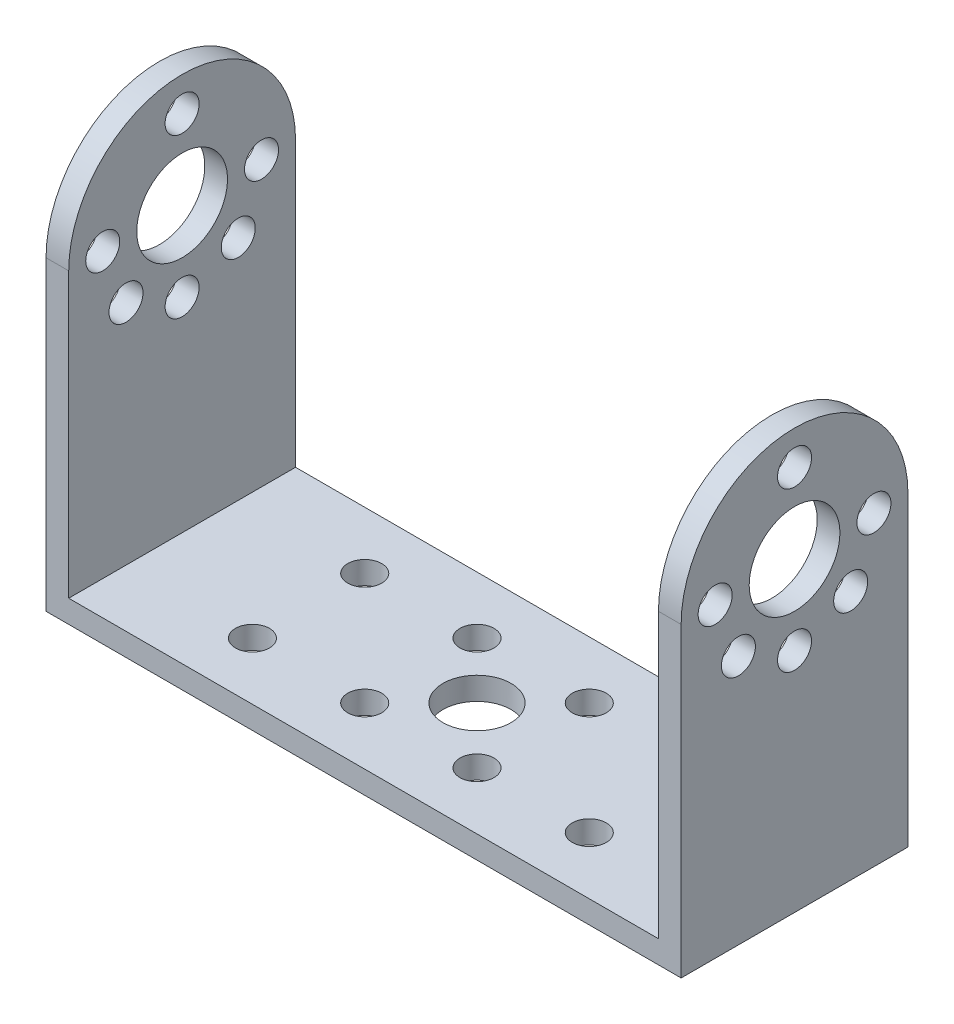
ISO-10303-21;
HEADER;
FILE_DESCRIPTION(('STEP AP214'),'2;1');
FILE_NAME('part.step','',(''),(''),'','','');
FILE_SCHEMA(('AUTOMOTIVE_DESIGN { 1 0 10303 214 1 1 1 1 }'));
ENDSEC;
DATA;
#1=APPLICATION_CONTEXT('core data for automotive mechanical design processes');
#2=APPLICATION_PROTOCOL_DEFINITION('international standard','automotive_design',2000,#1);
#3=PRODUCT_CONTEXT('',#1,'mechanical');
#4=PRODUCT('Part','Part','',(#3));
#5=PRODUCT_RELATED_PRODUCT_CATEGORY('part','',(#4));
#6=PRODUCT_DEFINITION_FORMATION('','',#4);
#7=PRODUCT_DEFINITION_CONTEXT('part definition',#1,'design');
#8=PRODUCT_DEFINITION('design','',#6,#7);
#9=PRODUCT_DEFINITION_SHAPE('','',#8);
#10=(LENGTH_UNIT() NAMED_UNIT(*) SI_UNIT(.MILLI.,.METRE.));
#11=(NAMED_UNIT(*) PLANE_ANGLE_UNIT() SI_UNIT($,.RADIAN.));
#12=(NAMED_UNIT(*) SI_UNIT($,.STERADIAN.) SOLID_ANGLE_UNIT());
#13=UNCERTAINTY_MEASURE_WITH_UNIT(LENGTH_MEASURE(1.E-05),#10,'distance_accuracy_value','');
#14=(GEOMETRIC_REPRESENTATION_CONTEXT(3) GLOBAL_UNCERTAINTY_ASSIGNED_CONTEXT((#13)) GLOBAL_UNIT_ASSIGNED_CONTEXT((#10,
#11,#12)) REPRESENTATION_CONTEXT('',''));
#15=CARTESIAN_POINT('',(0.,0.,0.));
#16=DIRECTION('',(0.,0.,1.));
#17=DIRECTION('',(1.,0.,0.));
#18=AXIS2_PLACEMENT_3D('',#15,#16,#17);
#19=CARTESIAN_POINT('',(0.,2.,0.));
#20=DIRECTION('',(0.,-1.,0.));
#21=DIRECTION('',(0.,0.,-1.));
#22=AXIS2_PLACEMENT_3D('',#19,#20,#21);
#23=PLANE('',#22);
#24=CARTESIAN_POINT('',(28.,2.,-10.));
#25=DIRECTION('',(0.,1.,0.));
#26=DIRECTION('',(0.,0.,1.));
#27=AXIS2_PLACEMENT_3D('',#24,#25,#26);
#28=CIRCLE('',#27,3.);
#29=CARTESIAN_POINT('',(28.,2.,-7.));
#30=VERTEX_POINT('',#29);
#31=EDGE_CURVE('E244',#30,#30,#28,.T.);
#32=ORIENTED_EDGE('',*,*,#31,.F.);
#33=EDGE_LOOP('',(#32));
#34=FACE_BOUND('',#33,.T.);
#35=CARTESIAN_POINT('',(32.9497474683058,2.,-5.05025253169419));
#36=DIRECTION('',(0.,1.,0.));
#37=DIRECTION('',(0.,0.,1.));
#38=AXIS2_PLACEMENT_3D('',#35,#36,#37);
#39=CIRCLE('',#38,1.5000000000001);
#40=CARTESIAN_POINT('',(32.9497474683058,2.,-3.55025253169409));
#41=VERTEX_POINT('',#40);
#42=EDGE_CURVE('E220',#41,#41,#39,.T.);
#43=ORIENTED_EDGE('',*,*,#42,.F.);
#44=EDGE_LOOP('',(#43));
#45=FACE_BOUND('',#44,.T.);
#46=CARTESIAN_POINT('',(23.0502525316941,2.,-5.05025253169419));
#47=DIRECTION('',(0.,1.,0.));
#48=DIRECTION('',(0.,0.,1.));
#49=AXIS2_PLACEMENT_3D('',#46,#47,#48);
#50=CIRCLE('',#49,1.50000000000009);
#51=CARTESIAN_POINT('',(23.0502525316941,2.,-3.5502525316941));
#52=VERTEX_POINT('',#51);
#53=EDGE_CURVE('E227',#52,#52,#50,.T.);
#54=ORIENTED_EDGE('',*,*,#53,.F.);
#55=EDGE_LOOP('',(#54));
#56=FACE_BOUND('',#55,.T.);
#57=CARTESIAN_POINT('',(23.0502525316941,2.,-14.9497474683058));
#58=DIRECTION('',(0.,1.,0.));
#59=DIRECTION('',(0.,0.,1.));
#60=AXIS2_PLACEMENT_3D('',#57,#58,#59);
#61=CIRCLE('',#60,1.50000000000002);
#62=CARTESIAN_POINT('',(23.0502525316941,2.,-13.4497474683058));
#63=VERTEX_POINT('',#62);
#64=EDGE_CURVE('E233',#63,#63,#61,.T.);
#65=ORIENTED_EDGE('',*,*,#64,.F.);
#66=EDGE_LOOP('',(#65));
#67=FACE_BOUND('',#66,.T.);
#68=CARTESIAN_POINT('',(32.9497474683058,2.,-14.9497474683058));
#69=DIRECTION('',(0.,1.,0.));
#70=DIRECTION('',(0.,0.,1.));
#71=AXIS2_PLACEMENT_3D('',#68,#69,#70);
#72=CIRCLE('',#71,1.5);
#73=CARTESIAN_POINT('',(32.9497474683058,2.,-13.4497474683058));
#74=VERTEX_POINT('',#73);
#75=EDGE_CURVE('E239',#74,#74,#72,.T.);
#76=ORIENTED_EDGE('',*,*,#75,.F.);
#77=EDGE_LOOP('',(#76));
#78=FACE_BOUND('',#77,.T.);
#79=CARTESIAN_POINT('',(13.1507575950825,2.,-14.9497474683059));
#80=DIRECTION('',(0.,1.,0.));
#81=DIRECTION('',(0.,0.,1.));
#82=AXIS2_PLACEMENT_3D('',#79,#80,#81);
#83=CIRCLE('',#82,1.5);
#84=CARTESIAN_POINT('',(13.1507575950825,2.,-13.4497474683059));
#85=VERTEX_POINT('',#84);
#86=EDGE_CURVE('E196',#85,#85,#83,.T.);
#87=ORIENTED_EDGE('',*,*,#86,.F.);
#88=EDGE_LOOP('',(#87));
#89=FACE_BOUND('',#88,.T.);
#90=CARTESIAN_POINT('',(13.1507575950825,2.,-5.05025253169414));
#91=DIRECTION('',(0.,1.,0.));
#92=DIRECTION('',(0.,0.,-1.));
#93=AXIS2_PLACEMENT_3D('',#90,#91,#92);
#94=CIRCLE('',#93,1.5);
#95=CARTESIAN_POINT('',(13.1507575950825,2.,-6.55025253169414));
#96=VERTEX_POINT('',#95);
#97=EDGE_CURVE('E203',#96,#96,#94,.T.);
#98=ORIENTED_EDGE('',*,*,#97,.F.);
#99=EDGE_LOOP('',(#98));
#100=FACE_BOUND('',#99,.T.);
#101=CARTESIAN_POINT('',(42.8492424049175,2.,-5.05025253169414));
#102=DIRECTION('',(0.,1.,0.));
#103=DIRECTION('',(0.,0.,1.));
#104=AXIS2_PLACEMENT_3D('',#101,#102,#103);
#105=CIRCLE('',#104,1.5);
#106=CARTESIAN_POINT('',(42.8492424049175,2.,-3.55025253169414));
#107=VERTEX_POINT('',#106);
#108=EDGE_CURVE('E209',#107,#107,#105,.T.);
#109=ORIENTED_EDGE('',*,*,#108,.F.);
#110=EDGE_LOOP('',(#109));
#111=FACE_BOUND('',#110,.T.);
#112=CARTESIAN_POINT('',(42.8492424049175,2.,-14.9497474683059));
#113=DIRECTION('',(0.,1.,0.));
#114=DIRECTION('',(0.,0.,-1.));
#115=AXIS2_PLACEMENT_3D('',#112,#113,#114);
#116=CIRCLE('',#115,1.5);
#117=CARTESIAN_POINT('',(42.8492424049175,2.,-16.4497474683059));
#118=VERTEX_POINT('',#117);
#119=EDGE_CURVE('E215',#118,#118,#116,.T.);
#120=ORIENTED_EDGE('',*,*,#119,.F.);
#121=EDGE_LOOP('',(#120));
#122=FACE_BOUND('',#121,.T.);
#123=DIRECTION('',(0.,0.,1.));
#124=VECTOR('',#123,1.);
#125=CARTESIAN_POINT('',(54.,2.,-20.));
#126=LINE('',#125,#124);
#127=CARTESIAN_POINT('',(54.,2.,-20.));
#128=VERTEX_POINT('',#127);
#129=CARTESIAN_POINT('',(54.,2.,0.));
#130=VERTEX_POINT('',#129);
#131=EDGE_CURVE('E55',#128,#130,#126,.T.);
#132=ORIENTED_EDGE('',*,*,#131,.F.);
#133=DIRECTION('',(-1.,0.,0.));
#134=VECTOR('',#133,1.);
#135=CARTESIAN_POINT('',(0.,2.,-20.));
#136=LINE('',#135,#134);
#137=CARTESIAN_POINT('',(2.,2.,-20.));
#138=VERTEX_POINT('',#137);
#139=EDGE_CURVE('E123',#128,#138,#136,.T.);
#140=ORIENTED_EDGE('',*,*,#139,.T.);
#141=DIRECTION('',(0.,0.,1.));
#142=VECTOR('',#141,1.);
#143=CARTESIAN_POINT('',(2.,2.,-20.));
#144=LINE('',#143,#142);
#145=CARTESIAN_POINT('',(2.,2.,0.));
#146=VERTEX_POINT('',#145);
#147=EDGE_CURVE('E179',#138,#146,#144,.T.);
#148=ORIENTED_EDGE('',*,*,#147,.T.);
#149=DIRECTION('',(1.,0.,0.));
#150=VECTOR('',#149,1.);
#151=CARTESIAN_POINT('',(0.,2.,0.));
#152=LINE('',#151,#150);
#153=EDGE_CURVE('E51',#146,#130,#152,.T.);
#154=ORIENTED_EDGE('',*,*,#153,.T.);
#155=EDGE_LOOP('',(#132,#140,#148,#154));
#156=FACE_BOUND('',#155,.T.);
#157=ADVANCED_FACE('F36',(#34,#45,#56,#67,#78,#89,#100,#111,#122,#156),#23,.F.);
#158=CARTESIAN_POINT('',(0.,2.,0.));
#159=DIRECTION('',(1.,0.,0.));
#160=DIRECTION('',(0.,0.,-1.));
#161=AXIS2_PLACEMENT_3D('',#158,#159,#160);
#162=PLANE('',#161);
#163=CARTESIAN_POINT('',(0.,27.,-17.));
#164=DIRECTION('',(-1.,0.,0.));
#165=DIRECTION('',(0.,0.,1.));
#166=AXIS2_PLACEMENT_3D('',#163,#164,#165);
#167=CIRCLE('',#166,1.5);
#168=CARTESIAN_POINT('',(0.,27.,-15.5));
#169=VERTEX_POINT('',#168);
#170=EDGE_CURVE('E133',#169,#169,#167,.T.);
#171=ORIENTED_EDGE('',*,*,#170,.F.);
#172=EDGE_LOOP('',(#171));
#173=FACE_BOUND('',#172,.T.);
#174=CARTESIAN_POINT('',(0.,22.0502525316942,-14.9497474683058));
#175=DIRECTION('',(-1.,0.,0.));
#176=DIRECTION('',(0.,0.,1.));
#177=AXIS2_PLACEMENT_3D('',#174,#175,#176);
#178=CIRCLE('',#177,1.5);
#179=CARTESIAN_POINT('',(0.,22.0502525316942,-13.4497474683058));
#180=VERTEX_POINT('',#179);
#181=EDGE_CURVE('E143',#180,#180,#178,.T.);
#182=ORIENTED_EDGE('',*,*,#181,.F.);
#183=EDGE_LOOP('',(#182));
#184=FACE_BOUND('',#183,.T.);
#185=CARTESIAN_POINT('',(0.,20.,-10.));
#186=DIRECTION('',(-1.,0.,0.));
#187=DIRECTION('',(0.,0.,1.));
#188=AXIS2_PLACEMENT_3D('',#185,#186,#187);
#189=CIRCLE('',#188,1.5);
#190=CARTESIAN_POINT('',(0.,20.,-8.5));
#191=VERTEX_POINT('',#190);
#192=EDGE_CURVE('E135',#191,#191,#189,.T.);
#193=ORIENTED_EDGE('',*,*,#192,.F.);
#194=EDGE_LOOP('',(#193));
#195=FACE_BOUND('',#194,.T.);
#196=CARTESIAN_POINT('',(0.,22.0502525316942,-5.05025253169417));
#197=DIRECTION('',(-1.,0.,0.));
#198=DIRECTION('',(0.,0.,1.));
#199=AXIS2_PLACEMENT_3D('',#196,#197,#198);
#200=CIRCLE('',#199,1.5);
#201=CARTESIAN_POINT('',(0.,22.0502525316942,-3.55025253169418));
#202=VERTEX_POINT('',#201);
#203=EDGE_CURVE('E142',#202,#202,#200,.T.);
#204=ORIENTED_EDGE('',*,*,#203,.F.);
#205=EDGE_LOOP('',(#204));
#206=FACE_BOUND('',#205,.T.);
#207=CARTESIAN_POINT('',(0.,27.,-3.));
#208=DIRECTION('',(-1.,0.,0.));
#209=DIRECTION('',(0.,0.,1.));
#210=AXIS2_PLACEMENT_3D('',#207,#208,#209);
#211=CIRCLE('',#210,1.5);
#212=CARTESIAN_POINT('',(0.,27.,-1.5));
#213=VERTEX_POINT('',#212);
#214=EDGE_CURVE('E161',#213,#213,#211,.T.);
#215=ORIENTED_EDGE('',*,*,#214,.F.);
#216=EDGE_LOOP('',(#215));
#217=FACE_BOUND('',#216,.T.);
#218=CARTESIAN_POINT('',(0.,34.,-10.));
#219=DIRECTION('',(-1.,0.,0.));
#220=DIRECTION('',(0.,0.,1.));
#221=AXIS2_PLACEMENT_3D('',#218,#219,#220);
#222=CIRCLE('',#221,1.5);
#223=CARTESIAN_POINT('',(0.,34.,-8.5));
#224=VERTEX_POINT('',#223);
#225=EDGE_CURVE('E153',#224,#224,#222,.T.);
#226=ORIENTED_EDGE('',*,*,#225,.F.);
#227=EDGE_LOOP('',(#226));
#228=FACE_BOUND('',#227,.T.);
#229=CARTESIAN_POINT('',(0.,27.,-10.));
#230=DIRECTION('',(-1.,0.,0.));
#231=DIRECTION('',(0.,0.,1.));
#232=AXIS2_PLACEMENT_3D('',#229,#230,#231);
#233=CIRCLE('',#232,4.);
#234=CARTESIAN_POINT('',(0.,27.,-6.));
#235=VERTEX_POINT('',#234);
#236=EDGE_CURVE('E160',#235,#235,#233,.T.);
#237=ORIENTED_EDGE('',*,*,#236,.F.);
#238=EDGE_LOOP('',(#237));
#239=FACE_BOUND('',#238,.T.);
#240=DIRECTION('',(0.,0.,1.));
#241=VECTOR('',#240,1.);
#242=CARTESIAN_POINT('',(0.,0.,0.));
#243=LINE('',#242,#241);
#244=CARTESIAN_POINT('',(0.,0.,-20.));
#245=VERTEX_POINT('',#244);
#246=CARTESIAN_POINT('',(0.,0.,0.));
#247=VERTEX_POINT('',#246);
#248=EDGE_CURVE('E247',#245,#247,#243,.T.);
#249=ORIENTED_EDGE('',*,*,#248,.T.);
#250=DIRECTION('',(0.,-1.,0.));
#251=VECTOR('',#250,1.);
#252=CARTESIAN_POINT('',(0.,2.,0.));
#253=LINE('',#252,#251);
#254=CARTESIAN_POINT('',(0.,27.,0.));
#255=VERTEX_POINT('',#254);
#256=EDGE_CURVE('E11',#255,#247,#253,.T.);
#257=ORIENTED_EDGE('',*,*,#256,.F.);
#258=CARTESIAN_POINT('',(0.,27.,-10.));
#259=DIRECTION('',(-1.,0.,0.));
#260=DIRECTION('',(0.,0.,1.));
#261=AXIS2_PLACEMENT_3D('',#258,#259,#260);
#262=CIRCLE('',#261,10.);
#263=CARTESIAN_POINT('',(0.,27.,-20.));
#264=VERTEX_POINT('',#263);
#265=EDGE_CURVE('E176',#255,#264,#262,.T.);
#266=ORIENTED_EDGE('',*,*,#265,.T.);
#267=DIRECTION('',(0.,-1.,0.));
#268=VECTOR('',#267,1.);
#269=CARTESIAN_POINT('',(0.,2.,-20.));
#270=LINE('',#269,#268);
#271=EDGE_CURVE('E253',#264,#245,#270,.T.);
#272=ORIENTED_EDGE('',*,*,#271,.T.);
#273=EDGE_LOOP('',(#249,#257,#266,#272));
#274=FACE_BOUND('',#273,.T.);
#275=ADVANCED_FACE('F38',(#173,#184,#195,#206,#217,#228,#239,#274),#162,.F.);
#276=CARTESIAN_POINT('',(0.,2.,0.));
#277=DIRECTION('',(0.,0.,-1.));
#278=DIRECTION('',(-1.,0.,0.));
#279=AXIS2_PLACEMENT_3D('',#276,#277,#278);
#280=PLANE('',#279);
#281=DIRECTION('',(1.,0.,0.));
#282=VECTOR('',#281,1.);
#283=CARTESIAN_POINT('',(0.,0.,0.));
#284=LINE('',#283,#282);
#285=CARTESIAN_POINT('',(56.,0.,0.));
#286=VERTEX_POINT('',#285);
#287=EDGE_CURVE('E256',#247,#286,#284,.T.);
#288=ORIENTED_EDGE('',*,*,#287,.T.);
#289=DIRECTION('',(0.,-1.,0.));
#290=VECTOR('',#289,1.);
#291=CARTESIAN_POINT('',(56.,2.,0.));
#292=LINE('',#291,#290);
#293=CARTESIAN_POINT('',(56.,27.,0.));
#294=VERTEX_POINT('',#293);
#295=EDGE_CURVE('E44',#294,#286,#292,.T.);
#296=ORIENTED_EDGE('',*,*,#295,.F.);
#297=DIRECTION('',(1.,0.,0.));
#298=VECTOR('',#297,1.);
#299=CARTESIAN_POINT('',(54.,27.,0.));
#300=LINE('',#299,#298);
#301=CARTESIAN_POINT('',(54.,27.,0.));
#302=VERTEX_POINT('',#301);
#303=EDGE_CURVE('E119',#302,#294,#300,.T.);
#304=ORIENTED_EDGE('',*,*,#303,.F.);
#305=DIRECTION('',(0.,1.,0.));
#306=VECTOR('',#305,1.);
#307=CARTESIAN_POINT('',(54.,2.,0.));
#308=LINE('',#307,#306);
#309=EDGE_CURVE('E106',#130,#302,#308,.T.);
#310=ORIENTED_EDGE('',*,*,#309,.F.);
#311=ORIENTED_EDGE('',*,*,#153,.F.);
#312=DIRECTION('',(0.,1.,0.));
#313=VECTOR('',#312,1.);
#314=CARTESIAN_POINT('',(2.,2.,0.));
#315=LINE('',#314,#313);
#316=CARTESIAN_POINT('',(2.,27.,0.));
#317=VERTEX_POINT('',#316);
#318=EDGE_CURVE('E181',#146,#317,#315,.T.);
#319=ORIENTED_EDGE('',*,*,#318,.T.);
#320=DIRECTION('',(-1.,0.,0.));
#321=VECTOR('',#320,1.);
#322=CARTESIAN_POINT('',(2.,27.,0.));
#323=LINE('',#322,#321);
#324=EDGE_CURVE('E187',#317,#255,#323,.T.);
#325=ORIENTED_EDGE('',*,*,#324,.T.);
#326=ORIENTED_EDGE('',*,*,#256,.T.);
#327=EDGE_LOOP('',(#288,#296,#304,#310,#311,#319,#325,#326));
#328=FACE_BOUND('',#327,.T.);
#329=ADVANCED_FACE('F282',(#328),#280,.F.);
#330=CARTESIAN_POINT('',(56.,2.,0.));
#331=DIRECTION('',(-1.,0.,0.));
#332=DIRECTION('',(0.,0.,1.));
#333=AXIS2_PLACEMENT_3D('',#330,#331,#332);
#334=PLANE('',#333);
#335=CARTESIAN_POINT('',(56.,27.,-17.));
#336=DIRECTION('',(-1.,0.,0.));
#337=DIRECTION('',(0.,0.,1.));
#338=AXIS2_PLACEMENT_3D('',#335,#336,#337);
#339=CIRCLE('',#338,1.5);
#340=CARTESIAN_POINT('',(56.,27.,-15.5));
#341=VERTEX_POINT('',#340);
#342=EDGE_CURVE('E620',#341,#341,#339,.T.);
#343=ORIENTED_EDGE('',*,*,#342,.T.);
#344=EDGE_LOOP('',(#343));
#345=FACE_BOUND('',#344,.T.);
#346=CARTESIAN_POINT('',(56.,22.0502525316942,-14.9497474683058));
#347=DIRECTION('',(-1.,0.,0.));
#348=DIRECTION('',(0.,0.,1.));
#349=AXIS2_PLACEMENT_3D('',#346,#347,#348);
#350=CIRCLE('',#349,1.5);
#351=CARTESIAN_POINT('',(56.,22.0502525316942,-13.4497474683058));
#352=VERTEX_POINT('',#351);
#353=EDGE_CURVE('E662',#352,#352,#350,.T.);
#354=ORIENTED_EDGE('',*,*,#353,.T.);
#355=EDGE_LOOP('',(#354));
#356=FACE_BOUND('',#355,.T.);
#357=CARTESIAN_POINT('',(56.,20.,-10.));
#358=DIRECTION('',(-1.,0.,0.));
#359=DIRECTION('',(0.,0.,1.));
#360=AXIS2_PLACEMENT_3D('',#357,#358,#359);
#361=CIRCLE('',#360,1.5);
#362=CARTESIAN_POINT('',(56.,20.,-8.5));
#363=VERTEX_POINT('',#362);
#364=EDGE_CURVE('E646',#363,#363,#361,.T.);
#365=ORIENTED_EDGE('',*,*,#364,.T.);
#366=EDGE_LOOP('',(#365));
#367=FACE_BOUND('',#366,.T.);
#368=CARTESIAN_POINT('',(56.,22.0502525316942,-5.05025253169417));
#369=DIRECTION('',(-1.,0.,0.));
#370=DIRECTION('',(0.,0.,1.));
#371=AXIS2_PLACEMENT_3D('',#368,#369,#370);
#372=CIRCLE('',#371,1.5);
#373=CARTESIAN_POINT('',(56.,22.0502525316942,-3.55025253169418));
#374=VERTEX_POINT('',#373);
#375=EDGE_CURVE('E641',#374,#374,#372,.T.);
#376=ORIENTED_EDGE('',*,*,#375,.T.);
#377=EDGE_LOOP('',(#376));
#378=FACE_BOUND('',#377,.T.);
#379=CARTESIAN_POINT('',(56.,27.,-3.));
#380=DIRECTION('',(-1.,0.,0.));
#381=DIRECTION('',(0.,0.,1.));
#382=AXIS2_PLACEMENT_3D('',#379,#380,#381);
#383=CIRCLE('',#382,1.5);
#384=CARTESIAN_POINT('',(56.,27.,-1.5));
#385=VERTEX_POINT('',#384);
#386=EDGE_CURVE('E635',#385,#385,#383,.T.);
#387=ORIENTED_EDGE('',*,*,#386,.T.);
#388=EDGE_LOOP('',(#387));
#389=FACE_BOUND('',#388,.T.);
#390=CARTESIAN_POINT('',(56.,34.,-10.));
#391=DIRECTION('',(-1.,0.,0.));
#392=DIRECTION('',(0.,0.,1.));
#393=AXIS2_PLACEMENT_3D('',#390,#391,#392);
#394=CIRCLE('',#393,1.5);
#395=CARTESIAN_POINT('',(56.,34.,-8.5));
#396=VERTEX_POINT('',#395);
#397=EDGE_CURVE('E629',#396,#396,#394,.T.);
#398=ORIENTED_EDGE('',*,*,#397,.T.);
#399=EDGE_LOOP('',(#398));
#400=FACE_BOUND('',#399,.T.);
#401=CARTESIAN_POINT('',(56.,27.,-10.));
#402=DIRECTION('',(-1.,0.,0.));
#403=DIRECTION('',(0.,0.,1.));
#404=AXIS2_PLACEMENT_3D('',#401,#402,#403);
#405=CIRCLE('',#404,4.);
#406=CARTESIAN_POINT('',(56.,27.,-6.));
#407=VERTEX_POINT('',#406);
#408=EDGE_CURVE('E125',#407,#407,#405,.T.);
#409=ORIENTED_EDGE('',*,*,#408,.T.);
#410=EDGE_LOOP('',(#409));
#411=FACE_BOUND('',#410,.T.);
#412=DIRECTION('',(0.,0.,-1.));
#413=VECTOR('',#412,1.);
#414=CARTESIAN_POINT('',(56.,0.,0.));
#415=LINE('',#414,#413);
#416=CARTESIAN_POINT('',(56.,0.,-20.));
#417=VERTEX_POINT('',#416);
#418=EDGE_CURVE('E258',#286,#417,#415,.T.);
#419=ORIENTED_EDGE('',*,*,#418,.T.);
#420=DIRECTION('',(0.,-1.,0.));
#421=VECTOR('',#420,1.);
#422=CARTESIAN_POINT('',(56.,2.,-20.));
#423=LINE('',#422,#421);
#424=CARTESIAN_POINT('',(56.,27.,-20.));
#425=VERTEX_POINT('',#424);
#426=EDGE_CURVE('E263',#425,#417,#423,.T.);
#427=ORIENTED_EDGE('',*,*,#426,.F.);
#428=CARTESIAN_POINT('',(56.,27.,-10.));
#429=DIRECTION('',(-1.,0.,0.));
#430=DIRECTION('',(0.,0.,1.));
#431=AXIS2_PLACEMENT_3D('',#428,#429,#430);
#432=CIRCLE('',#431,10.);
#433=EDGE_CURVE('E116',#294,#425,#432,.T.);
#434=ORIENTED_EDGE('',*,*,#433,.F.);
#435=ORIENTED_EDGE('',*,*,#295,.T.);
#436=EDGE_LOOP('',(#419,#427,#434,#435));
#437=FACE_BOUND('',#436,.T.);
#438=ADVANCED_FACE('F267',(#345,#356,#367,#378,#389,#400,#411,#437),#334,.F.);
#439=CARTESIAN_POINT('',(0.,2.,-20.));
#440=DIRECTION('',(0.,0.,1.));
#441=DIRECTION('',(1.,0.,0.));
#442=AXIS2_PLACEMENT_3D('',#439,#440,#441);
#443=PLANE('',#442);
#444=DIRECTION('',(-1.,0.,0.));
#445=VECTOR('',#444,1.);
#446=CARTESIAN_POINT('',(0.,0.,-20.));
#447=LINE('',#446,#445);
#448=EDGE_CURVE('E251',#417,#245,#447,.T.);
#449=ORIENTED_EDGE('',*,*,#448,.T.);
#450=ORIENTED_EDGE('',*,*,#271,.F.);
#451=DIRECTION('',(-1.,0.,0.));
#452=VECTOR('',#451,1.);
#453=CARTESIAN_POINT('',(2.,27.,-20.));
#454=LINE('',#453,#452);
#455=CARTESIAN_POINT('',(2.,27.,-20.));
#456=VERTEX_POINT('',#455);
#457=EDGE_CURVE('E190',#456,#264,#454,.T.);
#458=ORIENTED_EDGE('',*,*,#457,.F.);
#459=DIRECTION('',(0.,-1.,0.));
#460=VECTOR('',#459,1.);
#461=CARTESIAN_POINT('',(2.,2.,-20.));
#462=LINE('',#461,#460);
#463=EDGE_CURVE('E177',#456,#138,#462,.T.);
#464=ORIENTED_EDGE('',*,*,#463,.T.);
#465=ORIENTED_EDGE('',*,*,#139,.F.);
#466=DIRECTION('',(0.,-1.,0.));
#467=VECTOR('',#466,1.);
#468=CARTESIAN_POINT('',(54.,2.,-20.));
#469=LINE('',#468,#467);
#470=CARTESIAN_POINT('',(54.,27.,-20.));
#471=VERTEX_POINT('',#470);
#472=EDGE_CURVE('E104',#471,#128,#469,.T.);
#473=ORIENTED_EDGE('',*,*,#472,.F.);
#474=DIRECTION('',(1.,0.,0.));
#475=VECTOR('',#474,1.);
#476=CARTESIAN_POINT('',(54.,27.,-20.));
#477=LINE('',#476,#475);
#478=EDGE_CURVE('E113',#471,#425,#477,.T.);
#479=ORIENTED_EDGE('',*,*,#478,.T.);
#480=ORIENTED_EDGE('',*,*,#426,.T.);
#481=EDGE_LOOP('',(#449,#450,#458,#464,#465,#473,#479,#480));
#482=FACE_BOUND('',#481,.T.);
#483=ADVANCED_FACE('F121',(#482),#443,.F.);
#484=CARTESIAN_POINT('',(0.,0.,0.));
#485=DIRECTION('',(0.,-1.,0.));
#486=DIRECTION('',(0.,0.,-1.));
#487=AXIS2_PLACEMENT_3D('',#484,#485,#486);
#488=PLANE('',#487);
#489=CARTESIAN_POINT('',(42.8492424049175,0.,-14.9497474683059));
#490=DIRECTION('',(0.,-1.,0.));
#491=DIRECTION('',(0.,0.,-1.));
#492=AXIS2_PLACEMENT_3D('',#489,#490,#491);
#493=CIRCLE('',#492,1.5);
#494=CARTESIAN_POINT('',(42.8492424049175,0.,-16.4497474683059));
#495=VERTEX_POINT('',#494);
#496=EDGE_CURVE('E193',#495,#495,#493,.F.);
#497=ORIENTED_EDGE('',*,*,#496,.T.);
#498=EDGE_LOOP('',(#497));
#499=FACE_BOUND('',#498,.T.);
#500=CARTESIAN_POINT('',(42.8492424049175,0.,-5.05025253169414));
#501=DIRECTION('',(0.,-1.,0.));
#502=DIRECTION('',(0.,0.,-1.));
#503=AXIS2_PLACEMENT_3D('',#500,#501,#502);
#504=CIRCLE('',#503,1.5);
#505=CARTESIAN_POINT('',(42.8492424049175,0.,-6.55025253169415));
#506=VERTEX_POINT('',#505);
#507=EDGE_CURVE('E212',#506,#506,#504,.F.);
#508=ORIENTED_EDGE('',*,*,#507,.T.);
#509=EDGE_LOOP('',(#508));
#510=FACE_BOUND('',#509,.T.);
#511=CARTESIAN_POINT('',(13.1507575950825,0.,-5.05025253169414));
#512=DIRECTION('',(0.,-1.,0.));
#513=DIRECTION('',(0.,0.,-1.));
#514=AXIS2_PLACEMENT_3D('',#511,#512,#513);
#515=CIRCLE('',#514,1.5);
#516=CARTESIAN_POINT('',(13.1507575950825,0.,-6.55025253169414));
#517=VERTEX_POINT('',#516);
#518=EDGE_CURVE('E206',#517,#517,#515,.F.);
#519=ORIENTED_EDGE('',*,*,#518,.T.);
#520=EDGE_LOOP('',(#519));
#521=FACE_BOUND('',#520,.T.);
#522=CARTESIAN_POINT('',(13.1507575950825,0.,-14.9497474683059));
#523=DIRECTION('',(0.,-1.,0.));
#524=DIRECTION('',(0.,0.,-1.));
#525=AXIS2_PLACEMENT_3D('',#522,#523,#524);
#526=CIRCLE('',#525,1.5);
#527=CARTESIAN_POINT('',(13.1507575950825,0.,-16.4497474683059));
#528=VERTEX_POINT('',#527);
#529=EDGE_CURVE('E200',#528,#528,#526,.F.);
#530=ORIENTED_EDGE('',*,*,#529,.T.);
#531=EDGE_LOOP('',(#530));
#532=FACE_BOUND('',#531,.T.);
#533=CARTESIAN_POINT('',(32.9497474683058,0.,-14.9497474683058));
#534=DIRECTION('',(0.,-1.,0.));
#535=DIRECTION('',(0.,0.,-1.));
#536=AXIS2_PLACEMENT_3D('',#533,#534,#535);
#537=CIRCLE('',#536,1.5);
#538=CARTESIAN_POINT('',(32.9497474683058,0.,-16.4497474683059));
#539=VERTEX_POINT('',#538);
#540=EDGE_CURVE('E199',#539,#539,#537,.F.);
#541=ORIENTED_EDGE('',*,*,#540,.T.);
#542=EDGE_LOOP('',(#541));
#543=FACE_BOUND('',#542,.T.);
#544=CARTESIAN_POINT('',(23.0502525316941,0.,-14.9497474683058));
#545=DIRECTION('',(0.,-1.,0.));
#546=DIRECTION('',(0.,0.,-1.));
#547=AXIS2_PLACEMENT_3D('',#544,#545,#546);
#548=CIRCLE('',#547,1.50000000000002);
#549=CARTESIAN_POINT('',(23.0502525316941,0.,-16.4497474683059));
#550=VERTEX_POINT('',#549);
#551=EDGE_CURVE('E236',#550,#550,#548,.F.);
#552=ORIENTED_EDGE('',*,*,#551,.T.);
#553=EDGE_LOOP('',(#552));
#554=FACE_BOUND('',#553,.T.);
#555=CARTESIAN_POINT('',(23.0502525316941,0.,-5.05025253169419));
#556=DIRECTION('',(0.,-1.,0.));
#557=DIRECTION('',(0.,0.,-1.));
#558=AXIS2_PLACEMENT_3D('',#555,#556,#557);
#559=CIRCLE('',#558,1.50000000000009);
#560=CARTESIAN_POINT('',(23.0502525316941,0.,-6.55025253169427));
#561=VERTEX_POINT('',#560);
#562=EDGE_CURVE('E230',#561,#561,#559,.F.);
#563=ORIENTED_EDGE('',*,*,#562,.T.);
#564=EDGE_LOOP('',(#563));
#565=FACE_BOUND('',#564,.T.);
#566=CARTESIAN_POINT('',(32.9497474683058,0.,-5.05025253169419));
#567=DIRECTION('',(0.,-1.,0.));
#568=DIRECTION('',(0.,0.,-1.));
#569=AXIS2_PLACEMENT_3D('',#566,#567,#568);
#570=CIRCLE('',#569,1.5000000000001);
#571=CARTESIAN_POINT('',(32.9497474683058,0.,-6.55025253169429));
#572=VERTEX_POINT('',#571);
#573=EDGE_CURVE('E224',#572,#572,#570,.F.);
#574=ORIENTED_EDGE('',*,*,#573,.T.);
#575=EDGE_LOOP('',(#574));
#576=FACE_BOUND('',#575,.T.);
#577=CARTESIAN_POINT('',(28.,0.,-10.));
#578=DIRECTION('',(0.,-1.,0.));
#579=DIRECTION('',(0.,0.,-1.));
#580=AXIS2_PLACEMENT_3D('',#577,#578,#579);
#581=CIRCLE('',#580,3.);
#582=CARTESIAN_POINT('',(28.,0.,-13.));
#583=VERTEX_POINT('',#582);
#584=EDGE_CURVE('E223',#583,#583,#581,.F.);
#585=ORIENTED_EDGE('',*,*,#584,.T.);
#586=EDGE_LOOP('',(#585));
#587=FACE_BOUND('',#586,.T.);
#588=ORIENTED_EDGE('',*,*,#248,.F.);
#589=ORIENTED_EDGE('',*,*,#448,.F.);
#590=ORIENTED_EDGE('',*,*,#418,.F.);
#591=ORIENTED_EDGE('',*,*,#287,.F.);
#592=EDGE_LOOP('',(#588,#589,#590,#591));
#593=FACE_BOUND('',#592,.T.);
#594=ADVANCED_FACE('F272',(#499,#510,#521,#532,#543,#554,#565,#576,#587,#593),#488,.T.);
#595=CARTESIAN_POINT('',(28.,-0.00100000000000013,-10.));
#596=DIRECTION('',(0.,1.,0.));
#597=DIRECTION('',(0.,0.,1.));
#598=AXIS2_PLACEMENT_3D('',#595,#596,#597);
#599=CYLINDRICAL_SURFACE('',#598,3.);
#600=ORIENTED_EDGE('',*,*,#584,.F.);
#601=EDGE_LOOP('',(#600));
#602=FACE_BOUND('',#601,.T.);
#603=ORIENTED_EDGE('',*,*,#31,.T.);
#604=EDGE_LOOP('',(#603));
#605=FACE_BOUND('',#604,.T.);
#606=ADVANCED_FACE('F300',(#602,#605),#599,.F.);
#607=CARTESIAN_POINT('',(32.9497474683058,-0.00100000000000013,-5.05025253169419));
#608=DIRECTION('',(0.,1.,0.));
#609=DIRECTION('',(0.,0.,1.));
#610=AXIS2_PLACEMENT_3D('',#607,#608,#609);
#611=CYLINDRICAL_SURFACE('',#610,1.5000000000001);
#612=ORIENTED_EDGE('',*,*,#573,.F.);
#613=EDGE_LOOP('',(#612));
#614=FACE_BOUND('',#613,.T.);
#615=ORIENTED_EDGE('',*,*,#42,.T.);
#616=EDGE_LOOP('',(#615));
#617=FACE_BOUND('',#616,.T.);
#618=ADVANCED_FACE('F321',(#614,#617),#611,.F.);
#619=CARTESIAN_POINT('',(23.0502525316941,-0.00100000000000013,-5.05025253169419));
#620=DIRECTION('',(0.,1.,0.));
#621=DIRECTION('',(0.,0.,1.));
#622=AXIS2_PLACEMENT_3D('',#619,#620,#621);
#623=CYLINDRICAL_SURFACE('',#622,1.50000000000009);
#624=ORIENTED_EDGE('',*,*,#562,.F.);
#625=EDGE_LOOP('',(#624));
#626=FACE_BOUND('',#625,.T.);
#627=ORIENTED_EDGE('',*,*,#53,.T.);
#628=EDGE_LOOP('',(#627));
#629=FACE_BOUND('',#628,.T.);
#630=ADVANCED_FACE('F328',(#626,#629),#623,.F.);
#631=CARTESIAN_POINT('',(23.0502525316941,-0.00100000000000013,-14.9497474683058));
#632=DIRECTION('',(0.,1.,0.));
#633=DIRECTION('',(0.,0.,1.));
#634=AXIS2_PLACEMENT_3D('',#631,#632,#633);
#635=CYLINDRICAL_SURFACE('',#634,1.50000000000002);
#636=ORIENTED_EDGE('',*,*,#551,.F.);
#637=EDGE_LOOP('',(#636));
#638=FACE_BOUND('',#637,.T.);
#639=ORIENTED_EDGE('',*,*,#64,.T.);
#640=EDGE_LOOP('',(#639));
#641=FACE_BOUND('',#640,.T.);
#642=ADVANCED_FACE('F336',(#638,#641),#635,.F.);
#643=CARTESIAN_POINT('',(32.9497474683058,-0.00100000000000013,-14.9497474683058));
#644=DIRECTION('',(0.,1.,0.));
#645=DIRECTION('',(0.,0.,1.));
#646=AXIS2_PLACEMENT_3D('',#643,#644,#645);
#647=CYLINDRICAL_SURFACE('',#646,1.5);
#648=ORIENTED_EDGE('',*,*,#540,.F.);
#649=EDGE_LOOP('',(#648));
#650=FACE_BOUND('',#649,.T.);
#651=ORIENTED_EDGE('',*,*,#75,.T.);
#652=EDGE_LOOP('',(#651));
#653=FACE_BOUND('',#652,.T.);
#654=ADVANCED_FACE('F344',(#650,#653),#647,.F.);
#655=CARTESIAN_POINT('',(13.1507575950825,-0.00100000000000013,-14.9497474683059));
#656=DIRECTION('',(0.,1.,0.));
#657=DIRECTION('',(0.,0.,1.));
#658=AXIS2_PLACEMENT_3D('',#655,#656,#657);
#659=CYLINDRICAL_SURFACE('',#658,1.5);
#660=ORIENTED_EDGE('',*,*,#529,.F.);
#661=EDGE_LOOP('',(#660));
#662=FACE_BOUND('',#661,.T.);
#663=ORIENTED_EDGE('',*,*,#86,.T.);
#664=EDGE_LOOP('',(#663));
#665=FACE_BOUND('',#664,.T.);
#666=ADVANCED_FACE('F352',(#662,#665),#659,.F.);
#667=CARTESIAN_POINT('',(13.1507575950825,-0.00100000000000013,-5.05025253169414));
#668=DIRECTION('',(0.,1.,0.));
#669=DIRECTION('',(0.,0.,1.));
#670=AXIS2_PLACEMENT_3D('',#667,#668,#669);
#671=CYLINDRICAL_SURFACE('',#670,1.5);
#672=ORIENTED_EDGE('',*,*,#518,.F.);
#673=EDGE_LOOP('',(#672));
#674=FACE_BOUND('',#673,.T.);
#675=ORIENTED_EDGE('',*,*,#97,.T.);
#676=EDGE_LOOP('',(#675));
#677=FACE_BOUND('',#676,.T.);
#678=ADVANCED_FACE('F359',(#674,#677),#671,.F.);
#679=CARTESIAN_POINT('',(42.8492424049175,-0.00100000000000013,-5.05025253169414));
#680=DIRECTION('',(0.,1.,0.));
#681=DIRECTION('',(0.,0.,1.));
#682=AXIS2_PLACEMENT_3D('',#679,#680,#681);
#683=CYLINDRICAL_SURFACE('',#682,1.5);
#684=ORIENTED_EDGE('',*,*,#507,.F.);
#685=EDGE_LOOP('',(#684));
#686=FACE_BOUND('',#685,.T.);
#687=ORIENTED_EDGE('',*,*,#108,.T.);
#688=EDGE_LOOP('',(#687));
#689=FACE_BOUND('',#688,.T.);
#690=ADVANCED_FACE('F367',(#686,#689),#683,.F.);
#691=CARTESIAN_POINT('',(42.8492424049175,-0.00100000000000013,-14.9497474683059));
#692=DIRECTION('',(0.,1.,0.));
#693=DIRECTION('',(0.,0.,1.));
#694=AXIS2_PLACEMENT_3D('',#691,#692,#693);
#695=CYLINDRICAL_SURFACE('',#694,1.5);
#696=ORIENTED_EDGE('',*,*,#496,.F.);
#697=EDGE_LOOP('',(#696));
#698=FACE_BOUND('',#697,.T.);
#699=ORIENTED_EDGE('',*,*,#119,.T.);
#700=EDGE_LOOP('',(#699));
#701=FACE_BOUND('',#700,.T.);
#702=ADVANCED_FACE('F375',(#698,#701),#695,.F.);
#703=CARTESIAN_POINT('',(2.,27.,-10.));
#704=DIRECTION('',(-1.,0.,0.));
#705=DIRECTION('',(0.,0.,1.));
#706=AXIS2_PLACEMENT_3D('',#703,#704,#705);
#707=CYLINDRICAL_SURFACE('',#706,10.);
#708=ORIENTED_EDGE('',*,*,#265,.F.);
#709=ORIENTED_EDGE('',*,*,#324,.F.);
#710=CARTESIAN_POINT('',(2.,27.,-10.));
#711=DIRECTION('',(-1.,0.,0.));
#712=DIRECTION('',(0.,0.,1.));
#713=AXIS2_PLACEMENT_3D('',#710,#711,#712);
#714=CIRCLE('',#713,10.);
#715=EDGE_CURVE('E184',#317,#456,#714,.T.);
#716=ORIENTED_EDGE('',*,*,#715,.T.);
#717=ORIENTED_EDGE('',*,*,#457,.T.);
#718=EDGE_LOOP('',(#708,#709,#716,#717));
#719=FACE_BOUND('',#718,.T.);
#720=ADVANCED_FACE('F276',(#719),#707,.T.);
#721=CARTESIAN_POINT('',(2.,27.,-10.));
#722=DIRECTION('',(-1.,0.,0.));
#723=DIRECTION('',(0.,0.,1.));
#724=AXIS2_PLACEMENT_3D('',#721,#722,#723);
#725=PLANE('',#724);
#726=CARTESIAN_POINT('',(2.,27.,-17.));
#727=DIRECTION('',(-1.,0.,0.));
#728=DIRECTION('',(0.,0.,1.));
#729=AXIS2_PLACEMENT_3D('',#726,#727,#728);
#730=CIRCLE('',#729,1.5);
#731=CARTESIAN_POINT('',(2.,27.,-15.5));
#732=VERTEX_POINT('',#731);
#733=EDGE_CURVE('E146',#732,#732,#730,.F.);
#734=ORIENTED_EDGE('',*,*,#733,.F.);
#735=EDGE_LOOP('',(#734));
#736=FACE_BOUND('',#735,.T.);
#737=CARTESIAN_POINT('',(2.,22.0502525316942,-14.9497474683058));
#738=DIRECTION('',(-1.,0.,0.));
#739=DIRECTION('',(0.,0.,1.));
#740=AXIS2_PLACEMENT_3D('',#737,#738,#739);
#741=CIRCLE('',#740,1.5);
#742=CARTESIAN_POINT('',(2.,22.0502525316942,-13.4497474683058));
#743=VERTEX_POINT('',#742);
#744=EDGE_CURVE('E139',#743,#743,#741,.F.);
#745=ORIENTED_EDGE('',*,*,#744,.F.);
#746=EDGE_LOOP('',(#745));
#747=FACE_BOUND('',#746,.T.);
#748=CARTESIAN_POINT('',(2.,20.,-10.));
#749=DIRECTION('',(-1.,0.,0.));
#750=DIRECTION('',(0.,0.,1.));
#751=AXIS2_PLACEMENT_3D('',#748,#749,#750);
#752=CIRCLE('',#751,1.5);
#753=CARTESIAN_POINT('',(2.,20.,-8.5));
#754=VERTEX_POINT('',#753);
#755=EDGE_CURVE('E138',#754,#754,#752,.F.);
#756=ORIENTED_EDGE('',*,*,#755,.F.);
#757=EDGE_LOOP('',(#756));
#758=FACE_BOUND('',#757,.T.);
#759=CARTESIAN_POINT('',(2.,22.0502525316942,-5.05025253169417));
#760=DIRECTION('',(-1.,0.,0.));
#761=DIRECTION('',(0.,0.,1.));
#762=AXIS2_PLACEMENT_3D('',#759,#760,#761);
#763=CIRCLE('',#762,1.5);
#764=CARTESIAN_POINT('',(2.,22.0502525316942,-3.55025253169418));
#765=VERTEX_POINT('',#764);
#766=EDGE_CURVE('E164',#765,#765,#763,.F.);
#767=ORIENTED_EDGE('',*,*,#766,.F.);
#768=EDGE_LOOP('',(#767));
#769=FACE_BOUND('',#768,.T.);
#770=CARTESIAN_POINT('',(2.,27.,-3.));
#771=DIRECTION('',(-1.,0.,0.));
#772=DIRECTION('',(0.,0.,1.));
#773=AXIS2_PLACEMENT_3D('',#770,#771,#772);
#774=CIRCLE('',#773,1.5);
#775=CARTESIAN_POINT('',(2.,27.,-1.5));
#776=VERTEX_POINT('',#775);
#777=EDGE_CURVE('E157',#776,#776,#774,.F.);
#778=ORIENTED_EDGE('',*,*,#777,.F.);
#779=EDGE_LOOP('',(#778));
#780=FACE_BOUND('',#779,.T.);
#781=CARTESIAN_POINT('',(2.,34.,-10.));
#782=DIRECTION('',(-1.,0.,0.));
#783=DIRECTION('',(0.,0.,1.));
#784=AXIS2_PLACEMENT_3D('',#781,#782,#783);
#785=CIRCLE('',#784,1.5);
#786=CARTESIAN_POINT('',(2.,34.,-8.5));
#787=VERTEX_POINT('',#786);
#788=EDGE_CURVE('E156',#787,#787,#785,.F.);
#789=ORIENTED_EDGE('',*,*,#788,.F.);
#790=EDGE_LOOP('',(#789));
#791=FACE_BOUND('',#790,.T.);
#792=CARTESIAN_POINT('',(2.,27.,-10.));
#793=DIRECTION('',(-1.,0.,0.));
#794=DIRECTION('',(0.,0.,1.));
#795=AXIS2_PLACEMENT_3D('',#792,#793,#794);
#796=CIRCLE('',#795,4.);
#797=CARTESIAN_POINT('',(2.,27.,-6.));
#798=VERTEX_POINT('',#797);
#799=EDGE_CURVE('E173',#798,#798,#796,.F.);
#800=ORIENTED_EDGE('',*,*,#799,.F.);
#801=EDGE_LOOP('',(#800));
#802=FACE_BOUND('',#801,.T.);
#803=ORIENTED_EDGE('',*,*,#463,.F.);
#804=ORIENTED_EDGE('',*,*,#715,.F.);
#805=ORIENTED_EDGE('',*,*,#318,.F.);
#806=ORIENTED_EDGE('',*,*,#147,.F.);
#807=EDGE_LOOP('',(#803,#804,#805,#806));
#808=FACE_BOUND('',#807,.T.);
#809=ADVANCED_FACE('F281',(#736,#747,#758,#769,#780,#791,#802,#808),#725,.F.);
#810=CARTESIAN_POINT('',(56.001,27.,-10.));
#811=DIRECTION('',(-1.,0.,0.));
#812=DIRECTION('',(0.,0.,1.));
#813=AXIS2_PLACEMENT_3D('',#810,#811,#812);
#814=CYLINDRICAL_SURFACE('',#813,4.);
#815=ORIENTED_EDGE('',*,*,#236,.T.);
#816=EDGE_LOOP('',(#815));
#817=FACE_BOUND('',#816,.T.);
#818=ORIENTED_EDGE('',*,*,#799,.T.);
#819=EDGE_LOOP('',(#818));
#820=FACE_BOUND('',#819,.T.);
#821=ADVANCED_FACE('F397',(#817,#820),#814,.F.);
#822=CARTESIAN_POINT('',(56.001,34.,-10.));
#823=DIRECTION('',(-1.,0.,0.));
#824=DIRECTION('',(0.,0.,1.));
#825=AXIS2_PLACEMENT_3D('',#822,#823,#824);
#826=CYLINDRICAL_SURFACE('',#825,1.5);
#827=ORIENTED_EDGE('',*,*,#225,.T.);
#828=EDGE_LOOP('',(#827));
#829=FACE_BOUND('',#828,.T.);
#830=ORIENTED_EDGE('',*,*,#788,.T.);
#831=EDGE_LOOP('',(#830));
#832=FACE_BOUND('',#831,.T.);
#833=ADVANCED_FACE('F405',(#829,#832),#826,.F.);
#834=CARTESIAN_POINT('',(56.001,27.,-3.));
#835=DIRECTION('',(-1.,0.,0.));
#836=DIRECTION('',(0.,0.,1.));
#837=AXIS2_PLACEMENT_3D('',#834,#835,#836);
#838=CYLINDRICAL_SURFACE('',#837,1.5);
#839=ORIENTED_EDGE('',*,*,#214,.T.);
#840=EDGE_LOOP('',(#839));
#841=FACE_BOUND('',#840,.T.);
#842=ORIENTED_EDGE('',*,*,#777,.T.);
#843=EDGE_LOOP('',(#842));
#844=FACE_BOUND('',#843,.T.);
#845=ADVANCED_FACE('F413',(#841,#844),#838,.F.);
#846=CARTESIAN_POINT('',(56.001,22.0502525316942,-5.05025253169417));
#847=DIRECTION('',(-1.,0.,0.));
#848=DIRECTION('',(0.,0.,1.));
#849=AXIS2_PLACEMENT_3D('',#846,#847,#848);
#850=CYLINDRICAL_SURFACE('',#849,1.5);
#851=ORIENTED_EDGE('',*,*,#203,.T.);
#852=EDGE_LOOP('',(#851));
#853=FACE_BOUND('',#852,.T.);
#854=ORIENTED_EDGE('',*,*,#766,.T.);
#855=EDGE_LOOP('',(#854));
#856=FACE_BOUND('',#855,.T.);
#857=ADVANCED_FACE('F421',(#853,#856),#850,.F.);
#858=CARTESIAN_POINT('',(56.001,20.,-10.));
#859=DIRECTION('',(-1.,0.,0.));
#860=DIRECTION('',(0.,0.,1.));
#861=AXIS2_PLACEMENT_3D('',#858,#859,#860);
#862=CYLINDRICAL_SURFACE('',#861,1.5);
#863=ORIENTED_EDGE('',*,*,#192,.T.);
#864=EDGE_LOOP('',(#863));
#865=FACE_BOUND('',#864,.T.);
#866=ORIENTED_EDGE('',*,*,#755,.T.);
#867=EDGE_LOOP('',(#866));
#868=FACE_BOUND('',#867,.T.);
#869=ADVANCED_FACE('F429',(#865,#868),#862,.F.);
#870=CARTESIAN_POINT('',(56.001,22.0502525316942,-14.9497474683058));
#871=DIRECTION('',(-1.,0.,0.));
#872=DIRECTION('',(0.,0.,1.));
#873=AXIS2_PLACEMENT_3D('',#870,#871,#872);
#874=CYLINDRICAL_SURFACE('',#873,1.5);
#875=ORIENTED_EDGE('',*,*,#181,.T.);
#876=EDGE_LOOP('',(#875));
#877=FACE_BOUND('',#876,.T.);
#878=ORIENTED_EDGE('',*,*,#744,.T.);
#879=EDGE_LOOP('',(#878));
#880=FACE_BOUND('',#879,.T.);
#881=ADVANCED_FACE('F437',(#877,#880),#874,.F.);
#882=CARTESIAN_POINT('',(56.001,27.,-17.));
#883=DIRECTION('',(-1.,0.,0.));
#884=DIRECTION('',(0.,0.,1.));
#885=AXIS2_PLACEMENT_3D('',#882,#883,#884);
#886=CYLINDRICAL_SURFACE('',#885,1.5);
#887=ORIENTED_EDGE('',*,*,#170,.T.);
#888=EDGE_LOOP('',(#887));
#889=FACE_BOUND('',#888,.T.);
#890=ORIENTED_EDGE('',*,*,#733,.T.);
#891=EDGE_LOOP('',(#890));
#892=FACE_BOUND('',#891,.T.);
#893=ADVANCED_FACE('F445',(#889,#892),#886,.F.);
#894=CARTESIAN_POINT('',(54.,27.,-10.));
#895=DIRECTION('',(1.,0.,0.));
#896=DIRECTION('',(0.,0.,-1.));
#897=AXIS2_PLACEMENT_3D('',#894,#895,#896);
#898=CYLINDRICAL_SURFACE('',#897,10.);
#899=ORIENTED_EDGE('',*,*,#433,.T.);
#900=ORIENTED_EDGE('',*,*,#478,.F.);
#901=CARTESIAN_POINT('',(54.,27.,-10.));
#902=DIRECTION('',(-1.,0.,0.));
#903=DIRECTION('',(0.,0.,1.));
#904=AXIS2_PLACEMENT_3D('',#901,#902,#903);
#905=CIRCLE('',#904,10.);
#906=EDGE_CURVE('E100',#302,#471,#905,.T.);
#907=ORIENTED_EDGE('',*,*,#906,.F.);
#908=ORIENTED_EDGE('',*,*,#303,.T.);
#909=EDGE_LOOP('',(#899,#900,#907,#908));
#910=FACE_BOUND('',#909,.T.);
#911=ADVANCED_FACE('F114',(#910),#898,.T.);
#912=CARTESIAN_POINT('',(54.,27.,-10.));
#913=DIRECTION('',(1.,0.,0.));
#914=DIRECTION('',(0.,0.,1.));
#915=AXIS2_PLACEMENT_3D('',#912,#913,#914);
#916=PLANE('',#915);
#917=CARTESIAN_POINT('',(54.,27.,-17.));
#918=DIRECTION('',(1.,0.,0.));
#919=DIRECTION('',(0.,0.,-1.));
#920=AXIS2_PLACEMENT_3D('',#917,#918,#919);
#921=CIRCLE('',#920,1.5);
#922=CARTESIAN_POINT('',(54.,27.,-18.5));
#923=VERTEX_POINT('',#922);
#924=EDGE_CURVE('E623',#923,#923,#921,.T.);
#925=ORIENTED_EDGE('',*,*,#924,.T.);
#926=EDGE_LOOP('',(#925));
#927=FACE_BOUND('',#926,.T.);
#928=CARTESIAN_POINT('',(54.,22.0502525316942,-14.9497474683058));
#929=DIRECTION('',(1.,0.,0.));
#930=DIRECTION('',(0.,0.,-1.));
#931=AXIS2_PLACEMENT_3D('',#928,#929,#930);
#932=CIRCLE('',#931,1.5);
#933=CARTESIAN_POINT('',(54.,22.0502525316942,-16.4497474683058));
#934=VERTEX_POINT('',#933);
#935=EDGE_CURVE('E625',#934,#934,#932,.T.);
#936=ORIENTED_EDGE('',*,*,#935,.T.);
#937=EDGE_LOOP('',(#936));
#938=FACE_BOUND('',#937,.T.);
#939=CARTESIAN_POINT('',(54.,20.,-10.));
#940=DIRECTION('',(1.,0.,0.));
#941=DIRECTION('',(0.,0.,-1.));
#942=AXIS2_PLACEMENT_3D('',#939,#940,#941);
#943=CIRCLE('',#942,1.5);
#944=CARTESIAN_POINT('',(54.,20.,-11.5));
#945=VERTEX_POINT('',#944);
#946=EDGE_CURVE('E657',#945,#945,#943,.T.);
#947=ORIENTED_EDGE('',*,*,#946,.T.);
#948=EDGE_LOOP('',(#947));
#949=FACE_BOUND('',#948,.T.);
#950=CARTESIAN_POINT('',(54.,22.0502525316942,-5.05025253169417));
#951=DIRECTION('',(1.,0.,0.));
#952=DIRECTION('',(0.,0.,-1.));
#953=AXIS2_PLACEMENT_3D('',#950,#951,#952);
#954=CIRCLE('',#953,1.5);
#955=CARTESIAN_POINT('',(54.,22.0502525316942,-6.55025253169417));
#956=VERTEX_POINT('',#955);
#957=EDGE_CURVE('E644',#956,#956,#954,.T.);
#958=ORIENTED_EDGE('',*,*,#957,.T.);
#959=EDGE_LOOP('',(#958));
#960=FACE_BOUND('',#959,.T.);
#961=CARTESIAN_POINT('',(54.,27.,-3.));
#962=DIRECTION('',(1.,0.,0.));
#963=DIRECTION('',(0.,0.,-1.));
#964=AXIS2_PLACEMENT_3D('',#961,#962,#963);
#965=CIRCLE('',#964,1.5);
#966=CARTESIAN_POINT('',(54.,27.,-4.5));
#967=VERTEX_POINT('',#966);
#968=EDGE_CURVE('E638',#967,#967,#965,.T.);
#969=ORIENTED_EDGE('',*,*,#968,.T.);
#970=EDGE_LOOP('',(#969));
#971=FACE_BOUND('',#970,.T.);
#972=CARTESIAN_POINT('',(54.,34.,-10.));
#973=DIRECTION('',(1.,0.,0.));
#974=DIRECTION('',(0.,0.,-1.));
#975=AXIS2_PLACEMENT_3D('',#972,#973,#974);
#976=CIRCLE('',#975,1.5);
#977=CARTESIAN_POINT('',(54.,34.,-11.5));
#978=VERTEX_POINT('',#977);
#979=EDGE_CURVE('E632',#978,#978,#976,.T.);
#980=ORIENTED_EDGE('',*,*,#979,.T.);
#981=EDGE_LOOP('',(#980));
#982=FACE_BOUND('',#981,.T.);
#983=CARTESIAN_POINT('',(54.,27.,-10.));
#984=DIRECTION('',(1.,0.,0.));
#985=DIRECTION('',(0.,0.,-1.));
#986=AXIS2_PLACEMENT_3D('',#983,#984,#985);
#987=CIRCLE('',#986,4.);
#988=CARTESIAN_POINT('',(54.,27.,-14.));
#989=VERTEX_POINT('',#988);
#990=EDGE_CURVE('E128',#989,#989,#987,.T.);
#991=ORIENTED_EDGE('',*,*,#990,.T.);
#992=EDGE_LOOP('',(#991));
#993=FACE_BOUND('',#992,.T.);
#994=ORIENTED_EDGE('',*,*,#472,.T.);
#995=ORIENTED_EDGE('',*,*,#131,.T.);
#996=ORIENTED_EDGE('',*,*,#309,.T.);
#997=ORIENTED_EDGE('',*,*,#906,.T.);
#998=EDGE_LOOP('',(#994,#995,#996,#997));
#999=FACE_BOUND('',#998,.T.);
#1000=ADVANCED_FACE('F102',(#927,#938,#949,#960,#971,#982,#993,#999),#916,.F.);
#1001=CARTESIAN_POINT('',(-0.001000000000001,27.,-10.));
#1002=DIRECTION('',(1.,0.,0.));
#1003=DIRECTION('',(0.,0.,-1.));
#1004=AXIS2_PLACEMENT_3D('',#1001,#1002,#1003);
#1005=CYLINDRICAL_SURFACE('',#1004,4.);
#1006=ORIENTED_EDGE('',*,*,#408,.F.);
#1007=EDGE_LOOP('',(#1006));
#1008=FACE_BOUND('',#1007,.T.);
#1009=ORIENTED_EDGE('',*,*,#990,.F.);
#1010=EDGE_LOOP('',(#1009));
#1011=FACE_BOUND('',#1010,.T.);
#1012=ADVANCED_FACE('F465',(#1008,#1011),#1005,.F.);
#1013=CARTESIAN_POINT('',(-0.001000000000001,34.,-10.));
#1014=DIRECTION('',(1.,0.,0.));
#1015=DIRECTION('',(0.,0.,-1.));
#1016=AXIS2_PLACEMENT_3D('',#1013,#1014,#1015);
#1017=CYLINDRICAL_SURFACE('',#1016,1.5);
#1018=ORIENTED_EDGE('',*,*,#397,.F.);
#1019=EDGE_LOOP('',(#1018));
#1020=FACE_BOUND('',#1019,.T.);
#1021=ORIENTED_EDGE('',*,*,#979,.F.);
#1022=EDGE_LOOP('',(#1021));
#1023=FACE_BOUND('',#1022,.T.);
#1024=ADVANCED_FACE('F473',(#1020,#1023),#1017,.F.);
#1025=CARTESIAN_POINT('',(-0.001000000000001,27.,-3.));
#1026=DIRECTION('',(1.,0.,0.));
#1027=DIRECTION('',(0.,0.,-1.));
#1028=AXIS2_PLACEMENT_3D('',#1025,#1026,#1027);
#1029=CYLINDRICAL_SURFACE('',#1028,1.5);
#1030=ORIENTED_EDGE('',*,*,#386,.F.);
#1031=EDGE_LOOP('',(#1030));
#1032=FACE_BOUND('',#1031,.T.);
#1033=ORIENTED_EDGE('',*,*,#968,.F.);
#1034=EDGE_LOOP('',(#1033));
#1035=FACE_BOUND('',#1034,.T.);
#1036=ADVANCED_FACE('F481',(#1032,#1035),#1029,.F.);
#1037=CARTESIAN_POINT('',(-0.001000000000001,22.0502525316942,-5.05025253169417));
#1038=DIRECTION('',(1.,0.,0.));
#1039=DIRECTION('',(0.,0.,-1.));
#1040=AXIS2_PLACEMENT_3D('',#1037,#1038,#1039);
#1041=CYLINDRICAL_SURFACE('',#1040,1.5);
#1042=ORIENTED_EDGE('',*,*,#375,.F.);
#1043=EDGE_LOOP('',(#1042));
#1044=FACE_BOUND('',#1043,.T.);
#1045=ORIENTED_EDGE('',*,*,#957,.F.);
#1046=EDGE_LOOP('',(#1045));
#1047=FACE_BOUND('',#1046,.T.);
#1048=ADVANCED_FACE('F489',(#1044,#1047),#1041,.F.);
#1049=CARTESIAN_POINT('',(-0.001000000000001,20.,-10.));
#1050=DIRECTION('',(1.,0.,0.));
#1051=DIRECTION('',(0.,0.,-1.));
#1052=AXIS2_PLACEMENT_3D('',#1049,#1050,#1051);
#1053=CYLINDRICAL_SURFACE('',#1052,1.5);
#1054=ORIENTED_EDGE('',*,*,#364,.F.);
#1055=EDGE_LOOP('',(#1054));
#1056=FACE_BOUND('',#1055,.T.);
#1057=ORIENTED_EDGE('',*,*,#946,.F.);
#1058=EDGE_LOOP('',(#1057));
#1059=FACE_BOUND('',#1058,.T.);
#1060=ADVANCED_FACE('F497',(#1056,#1059),#1053,.F.);
#1061=CARTESIAN_POINT('',(-0.001000000000001,22.0502525316942,-14.9497474683058));
#1062=DIRECTION('',(1.,0.,0.));
#1063=DIRECTION('',(0.,0.,-1.));
#1064=AXIS2_PLACEMENT_3D('',#1061,#1062,#1063);
#1065=CYLINDRICAL_SURFACE('',#1064,1.5);
#1066=ORIENTED_EDGE('',*,*,#353,.F.);
#1067=EDGE_LOOP('',(#1066));
#1068=FACE_BOUND('',#1067,.T.);
#1069=ORIENTED_EDGE('',*,*,#935,.F.);
#1070=EDGE_LOOP('',(#1069));
#1071=FACE_BOUND('',#1070,.T.);
#1072=ADVANCED_FACE('F505',(#1068,#1071),#1065,.F.);
#1073=CARTESIAN_POINT('',(-0.001000000000001,27.,-17.));
#1074=DIRECTION('',(1.,0.,0.));
#1075=DIRECTION('',(0.,0.,-1.));
#1076=AXIS2_PLACEMENT_3D('',#1073,#1074,#1075);
#1077=CYLINDRICAL_SURFACE('',#1076,1.5);
#1078=ORIENTED_EDGE('',*,*,#342,.F.);
#1079=EDGE_LOOP('',(#1078));
#1080=FACE_BOUND('',#1079,.T.);
#1081=ORIENTED_EDGE('',*,*,#924,.F.);
#1082=EDGE_LOOP('',(#1081));
#1083=FACE_BOUND('',#1082,.T.);
#1084=ADVANCED_FACE('F513',(#1080,#1083),#1077,.F.);
#1085=CLOSED_SHELL('',(#157,#275,#329,#438,#483,#594,#606,#618,#630,#642,#654,#666,#678,#690,
#702,#720,#809,#821,#833,#845,#857,#869,#881,#893,#911,#1000,#1012,#1024,#1036,#1048,#1060,
#1072,#1084));
#1086=MANIFOLD_SOLID_BREP('B2',#1085);
#1087=ADVANCED_BREP_SHAPE_REPRESENTATION('',(#18,#1086),#14);
#1088=SHAPE_DEFINITION_REPRESENTATION(#9,#1087);
ENDSEC;
END-ISO-10303-21;
